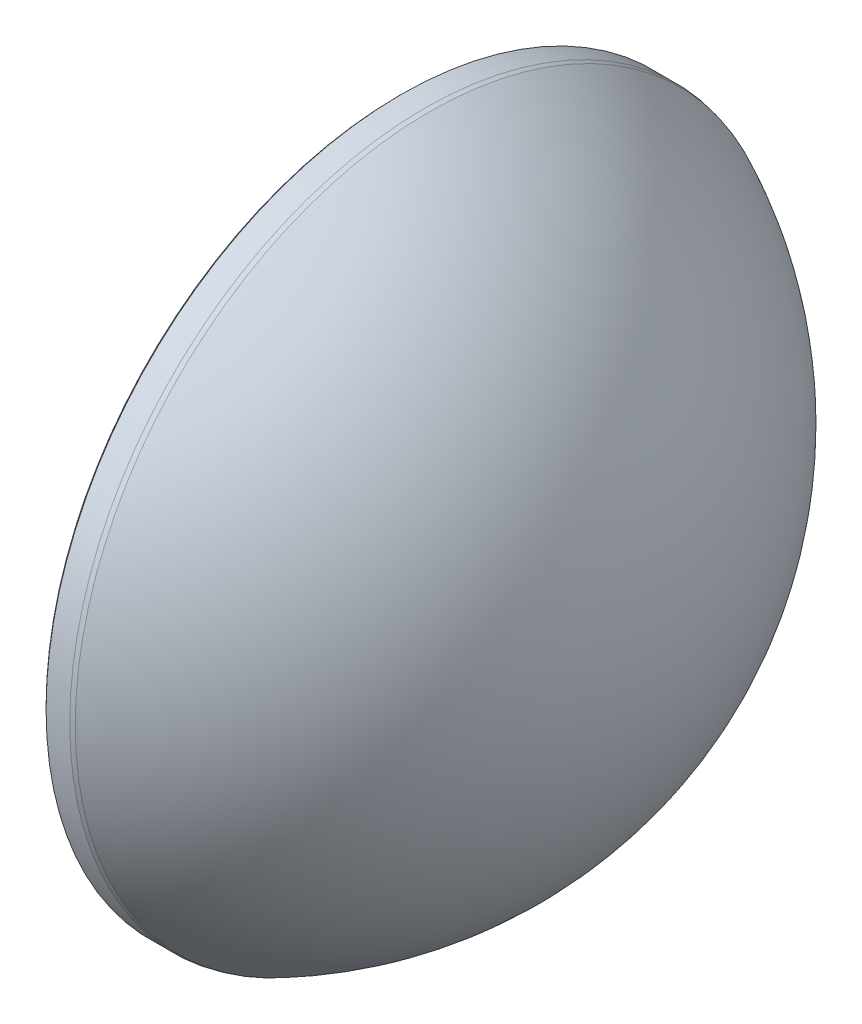
ISO-10303-21;
HEADER;
FILE_DESCRIPTION(('STEP AP214'),'2;1');
FILE_NAME('part.step','',(''),(''),'','','');
FILE_SCHEMA(('AUTOMOTIVE_DESIGN { 1 0 10303 214 1 1 1 1 }'));
ENDSEC;
DATA;
#1=APPLICATION_CONTEXT('core data for automotive mechanical design processes');
#2=APPLICATION_PROTOCOL_DEFINITION('international standard','automotive_design',2000,#1);
#3=PRODUCT_CONTEXT('',#1,'mechanical');
#4=PRODUCT('Part','Part','',(#3));
#5=PRODUCT_RELATED_PRODUCT_CATEGORY('part','',(#4));
#6=PRODUCT_DEFINITION_FORMATION('','',#4);
#7=PRODUCT_DEFINITION_CONTEXT('part definition',#1,'design');
#8=PRODUCT_DEFINITION('design','',#6,#7);
#9=PRODUCT_DEFINITION_SHAPE('','',#8);
#10=(LENGTH_UNIT() NAMED_UNIT(*) SI_UNIT(.MILLI.,.METRE.));
#11=(NAMED_UNIT(*) PLANE_ANGLE_UNIT() SI_UNIT($,.RADIAN.));
#12=(NAMED_UNIT(*) SI_UNIT($,.STERADIAN.) SOLID_ANGLE_UNIT());
#13=UNCERTAINTY_MEASURE_WITH_UNIT(LENGTH_MEASURE(1.E-05),#10,'distance_accuracy_value','');
#14=(GEOMETRIC_REPRESENTATION_CONTEXT(3) GLOBAL_UNCERTAINTY_ASSIGNED_CONTEXT((#13)) GLOBAL_UNIT_ASSIGNED_CONTEXT((#10,
#11,#12)) REPRESENTATION_CONTEXT('',''));
#15=CARTESIAN_POINT('',(0.,0.,0.));
#16=DIRECTION('',(0.,0.,1.));
#17=DIRECTION('',(1.,0.,0.));
#18=AXIS2_PLACEMENT_3D('',#15,#16,#17);
#19=CARTESIAN_POINT('',(-13.45,0.,0.));
#20=DIRECTION('',(1.,0.,0.));
#21=DIRECTION('',(0.,0.,-1.));
#22=AXIS2_PLACEMENT_3D('',#19,#20,#21);
#23=PLANE('',#22);
#24=CARTESIAN_POINT('',(-13.45,0.,0.));
#25=DIRECTION('',(1.,0.,0.));
#26=DIRECTION('',(0.,0.,-1.));
#27=AXIS2_PLACEMENT_3D('',#24,#25,#26);
#28=CIRCLE('',#27,37.25);
#29=CARTESIAN_POINT('',(-13.45,0.,-37.25));
#30=VERTEX_POINT('',#29);
#31=EDGE_CURVE('E10',#30,#30,#28,.F.);
#32=ORIENTED_EDGE('',*,*,#31,.T.);
#33=EDGE_LOOP('',(#32));
#34=FACE_BOUND('',#33,.T.);
#35=ADVANCED_FACE('F15',(#34),#23,.F.);
#36=CARTESIAN_POINT('',(-13.45,0.,0.));
#37=DIRECTION('',(-1.,0.,0.));
#38=DIRECTION('',(0.,0.,1.));
#39=AXIS2_PLACEMENT_3D('',#36,#37,#38);
#40=CYLINDRICAL_SURFACE('',#39,37.5);
#41=CARTESIAN_POINT('',(-10.7,0.,0.));
#42=DIRECTION('',(-1.,0.,0.));
#43=DIRECTION('',(0.,0.,1.));
#44=AXIS2_PLACEMENT_3D('',#41,#42,#43);
#45=CIRCLE('',#44,37.5);
#46=CARTESIAN_POINT('',(-10.7,0.,37.5));
#47=VERTEX_POINT('',#46);
#48=EDGE_CURVE('E55',#47,#47,#45,.T.);
#49=ORIENTED_EDGE('',*,*,#48,.T.);
#50=EDGE_LOOP('',(#49));
#51=FACE_BOUND('',#50,.T.);
#52=CARTESIAN_POINT('',(-13.2,0.,0.));
#53=DIRECTION('',(1.,0.,0.));
#54=DIRECTION('',(0.,0.,-1.));
#55=AXIS2_PLACEMENT_3D('',#52,#53,#54);
#56=CIRCLE('',#55,37.5);
#57=CARTESIAN_POINT('',(-13.2,0.,-37.5));
#58=VERTEX_POINT('',#57);
#59=EDGE_CURVE('E53',#58,#58,#56,.T.);
#60=ORIENTED_EDGE('',*,*,#59,.T.);
#61=EDGE_LOOP('',(#60));
#62=FACE_BOUND('',#61,.T.);
#63=ADVANCED_FACE('F28',(#51,#62),#40,.T.);
#64=CARTESIAN_POINT('',(-27.9499954246665,0.,-0.0194637506541369));
#65=DIRECTION('',(0.,-1.,0.));
#66=DIRECTION('',(0.,0.,1.));
#67=AXIS2_PLACEMENT_3D('',#64,#65,#66);
#68=CIRCLE('',#67,41.4);
#69=TRIMMED_CURVE('',#68,(PARAMETER_VALUE(-1.57032618787289)),
(PARAMETER_VALUE(1.57032618787289)),.T.,.PARAMETER.);
#70=CARTESIAN_POINT('',(-27.9499954246665,0.,0.));
#71=DIRECTION('',(-1.,0.,0.));
#72=AXIS1_PLACEMENT('',#70,#71);
#73=SURFACE_OF_REVOLUTION('',#69,#72);
#74=CARTESIAN_POINT('',(-10.2267476076433,0.,0.));
#75=DIRECTION('',(-1.,0.,0.));
#76=DIRECTION('',(0.,0.,1.));
#77=AXIS2_PLACEMENT_3D('',#74,#75,#76);
#78=CIRCLE('',#77,37.3950586546416);
#79=CARTESIAN_POINT('',(-10.2267476076433,0.,37.3950586546416));
#80=VERTEX_POINT('',#79);
#81=EDGE_CURVE('E22',#80,#80,#78,.F.);
#82=ORIENTED_EDGE('',*,*,#81,.T.);
#83=EDGE_LOOP('',(#82));
#84=FACE_BOUND('',#83,.T.);
#85=CARTESIAN_POINT('',(13.45,0.,0.));
#86=VERTEX_POINT('',#85);
#87=VERTEX_LOOP('',#86);
#88=FACE_BOUND('',#87,.T.);
#89=ADVANCED_FACE('F25',(#84,#88),#73,.T.);
#90=CARTESIAN_POINT('',(-10.7,0.,0.));
#91=DIRECTION('',(-1.,0.,0.));
#92=DIRECTION('',(0.,0.,1.));
#93=AXIS2_PLACEMENT_3D('',#90,#91,#92);
#94=CONICAL_SURFACE('',#93,37.5,0.218214122377822);
#95=ORIENTED_EDGE('',*,*,#81,.F.);
#96=EDGE_LOOP('',(#95));
#97=FACE_BOUND('',#96,.T.);
#98=ORIENTED_EDGE('',*,*,#48,.F.);
#99=EDGE_LOOP('',(#98));
#100=FACE_BOUND('',#99,.T.);
#101=ADVANCED_FACE('F27',(#97,#100),#94,.T.);
#102=CARTESIAN_POINT('',(-13.45,0.,0.));
#103=DIRECTION('',(1.,0.,0.));
#104=DIRECTION('',(0.,0.,-1.));
#105=AXIS2_PLACEMENT_3D('',#102,#103,#104);
#106=CONICAL_SURFACE('',#105,37.25,0.785398163397476);
#107=ORIENTED_EDGE('',*,*,#59,.F.);
#108=EDGE_LOOP('',(#107));
#109=FACE_BOUND('',#108,.T.);
#110=ORIENTED_EDGE('',*,*,#31,.F.);
#111=EDGE_LOOP('',(#110));
#112=FACE_BOUND('',#111,.T.);
#113=ADVANCED_FACE('F17',(#109,#112),#106,.T.);
#114=CLOSED_SHELL('',(#35,#63,#89,#101,#113));
#115=MANIFOLD_SOLID_BREP('B1',#114);
#116=ADVANCED_BREP_SHAPE_REPRESENTATION('',(#18,#115),#14);
#117=SHAPE_DEFINITION_REPRESENTATION(#9,#116);
ENDSEC;
END-ISO-10303-21;
